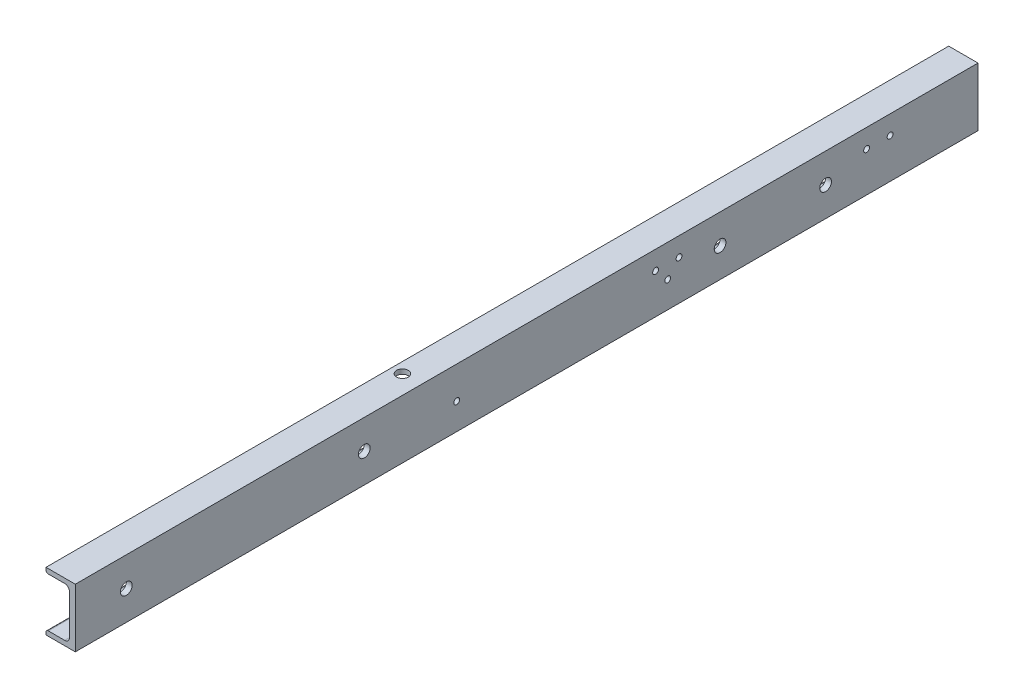
ISO-10303-21;
HEADER;
FILE_DESCRIPTION(('STEP AP214'),'2;1');
FILE_NAME('part.step','',(''),(''),'','','');
FILE_SCHEMA(('AUTOMOTIVE_DESIGN { 1 0 10303 214 1 1 1 1 }'));
ENDSEC;
DATA;
#1=APPLICATION_CONTEXT('core data for automotive mechanical design processes');
#2=APPLICATION_PROTOCOL_DEFINITION('international standard','automotive_design',2000,#1);
#3=PRODUCT_CONTEXT('',#1,'mechanical');
#4=PRODUCT('Part','Part','',(#3));
#5=PRODUCT_RELATED_PRODUCT_CATEGORY('part','',(#4));
#6=PRODUCT_DEFINITION_FORMATION('','',#4);
#7=PRODUCT_DEFINITION_CONTEXT('part definition',#1,'design');
#8=PRODUCT_DEFINITION('design','',#6,#7);
#9=PRODUCT_DEFINITION_SHAPE('','',#8);
#10=(LENGTH_UNIT() NAMED_UNIT(*) SI_UNIT(.MILLI.,.METRE.));
#11=(NAMED_UNIT(*) PLANE_ANGLE_UNIT() SI_UNIT($,.RADIAN.));
#12=(NAMED_UNIT(*) SI_UNIT($,.STERADIAN.) SOLID_ANGLE_UNIT());
#13=UNCERTAINTY_MEASURE_WITH_UNIT(LENGTH_MEASURE(1.E-05),#10,'distance_accuracy_value','');
#14=(GEOMETRIC_REPRESENTATION_CONTEXT(3) GLOBAL_UNCERTAINTY_ASSIGNED_CONTEXT((#13)) GLOBAL_UNIT_ASSIGNED_CONTEXT((#10,
#11,#12)) REPRESENTATION_CONTEXT('',''));
#15=CARTESIAN_POINT('',(0.,0.,0.));
#16=DIRECTION('',(0.,0.,1.));
#17=DIRECTION('',(1.,0.,0.));
#18=AXIS2_PLACEMENT_3D('',#15,#16,#17);
#19=CARTESIAN_POINT('',(-23.,47.9999999999999,-770.));
#20=DIRECTION('',(0.,0.,1.));
#21=DIRECTION('',(1.,0.,0.));
#22=AXIS2_PLACEMENT_3D('',#19,#20,#21);
#23=CYLINDRICAL_SURFACE('',#22,2.00000000000001);
#24=CARTESIAN_POINT('',(-23.,47.9999999999999,0.));
#25=DIRECTION('',(0.,0.,-1.));
#26=DIRECTION('',(-1.,0.,0.));
#27=AXIS2_PLACEMENT_3D('',#24,#25,#26);
#28=CIRCLE('',#27,2.00000000000001);
#29=CARTESIAN_POINT('',(-23.,45.9999999999999,0.));
#30=VERTEX_POINT('',#29);
#31=CARTESIAN_POINT('',(-25.,47.9999999999999,0.));
#32=VERTEX_POINT('',#31);
#33=EDGE_CURVE('E194',#30,#32,#28,.T.);
#34=ORIENTED_EDGE('',*,*,#33,.T.);
#35=DIRECTION('',(0.,0.,1.));
#36=VECTOR('',#35,1.);
#37=CARTESIAN_POINT('',(-25.,47.9999999999999,-770.));
#38=LINE('',#37,#36);
#39=CARTESIAN_POINT('',(-25.,47.9999999999999,-770.));
#40=VERTEX_POINT('',#39);
#41=EDGE_CURVE('E12',#40,#32,#38,.T.);
#42=ORIENTED_EDGE('',*,*,#41,.F.);
#43=CARTESIAN_POINT('',(-23.,47.9999999999999,-770.));
#44=DIRECTION('',(0.,0.,-1.));
#45=DIRECTION('',(-1.,0.,0.));
#46=AXIS2_PLACEMENT_3D('',#43,#44,#45);
#47=CIRCLE('',#46,2.00000000000001);
#48=CARTESIAN_POINT('',(-23.,45.9999999999999,-770.));
#49=VERTEX_POINT('',#48);
#50=EDGE_CURVE('E217',#49,#40,#47,.T.);
#51=ORIENTED_EDGE('',*,*,#50,.F.);
#52=DIRECTION('',(0.,0.,1.));
#53=VECTOR('',#52,1.);
#54=CARTESIAN_POINT('',(-23.,45.9999999999999,-770.));
#55=LINE('',#54,#53);
#56=EDGE_CURVE('E190',#49,#30,#55,.T.);
#57=ORIENTED_EDGE('',*,*,#56,.T.);
#58=EDGE_LOOP('',(#34,#42,#51,#57));
#59=FACE_BOUND('',#58,.T.);
#60=ADVANCED_FACE('F72',(#59),#23,.T.);
#61=CARTESIAN_POINT('',(-25.,50.,-770.));
#62=DIRECTION('',(1.,0.,0.));
#63=DIRECTION('',(0.,0.,-1.));
#64=AXIS2_PLACEMENT_3D('',#61,#62,#63);
#65=PLANE('',#64);
#66=DIRECTION('',(0.,1.,0.));
#67=VECTOR('',#66,1.);
#68=CARTESIAN_POINT('',(-25.,50.,0.));
#69=LINE('',#68,#67);
#70=CARTESIAN_POINT('',(-25.,50.,0.));
#71=VERTEX_POINT('',#70);
#72=EDGE_CURVE('E197',#32,#71,#69,.T.);
#73=ORIENTED_EDGE('',*,*,#72,.T.);
#74=DIRECTION('',(0.,0.,1.));
#75=VECTOR('',#74,1.);
#76=CARTESIAN_POINT('',(-25.,50.,-770.));
#77=LINE('',#76,#75);
#78=CARTESIAN_POINT('',(-25.,50.,-770.));
#79=VERTEX_POINT('',#78);
#80=EDGE_CURVE('E81',#79,#71,#77,.T.);
#81=ORIENTED_EDGE('',*,*,#80,.F.);
#82=DIRECTION('',(0.,1.,0.));
#83=VECTOR('',#82,1.);
#84=CARTESIAN_POINT('',(-25.,50.,-770.));
#85=LINE('',#84,#83);
#86=EDGE_CURVE('E145',#40,#79,#85,.T.);
#87=ORIENTED_EDGE('',*,*,#86,.F.);
#88=ORIENTED_EDGE('',*,*,#41,.T.);
#89=EDGE_LOOP('',(#73,#81,#87,#88));
#90=FACE_BOUND('',#89,.T.);
#91=ADVANCED_FACE('F354',(#90),#65,.F.);
#92=CARTESIAN_POINT('',(-25.,50.,-770.));
#93=DIRECTION('',(0.,-1.,0.));
#94=DIRECTION('',(1.,0.,0.));
#95=AXIS2_PLACEMENT_3D('',#92,#93,#94);
#96=PLANE('',#95);
#97=CARTESIAN_POINT('',(-16.,50.,-295.));
#98=DIRECTION('',(0.,-1.,0.));
#99=DIRECTION('',(1.,0.,0.));
#100=AXIS2_PLACEMENT_3D('',#97,#98,#99);
#101=CIRCLE('',#100,5.00000000000001);
#102=CARTESIAN_POINT('',(-11.,50.,-295.));
#103=VERTEX_POINT('',#102);
#104=EDGE_CURVE('E252',#103,#103,#101,.T.);
#105=ORIENTED_EDGE('',*,*,#104,.T.);
#106=EDGE_LOOP('',(#105));
#107=FACE_BOUND('',#106,.T.);
#108=DIRECTION('',(1.,0.,0.));
#109=VECTOR('',#108,1.);
#110=CARTESIAN_POINT('',(-25.,50.,0.));
#111=LINE('',#110,#109);
#112=CARTESIAN_POINT('',(0.,50.,0.));
#113=VERTEX_POINT('',#112);
#114=EDGE_CURVE('E200',#71,#113,#111,.T.);
#115=ORIENTED_EDGE('',*,*,#114,.T.);
#116=DIRECTION('',(0.,0.,1.));
#117=VECTOR('',#116,1.);
#118=CARTESIAN_POINT('',(0.,50.,-770.));
#119=LINE('',#118,#117);
#120=CARTESIAN_POINT('',(0.,50.,-770.));
#121=VERTEX_POINT('',#120);
#122=EDGE_CURVE('E236',#121,#113,#119,.T.);
#123=ORIENTED_EDGE('',*,*,#122,.F.);
#124=DIRECTION('',(1.,0.,0.));
#125=VECTOR('',#124,1.);
#126=CARTESIAN_POINT('',(-25.,50.,-770.));
#127=LINE('',#126,#125);
#128=EDGE_CURVE('E314',#79,#121,#127,.T.);
#129=ORIENTED_EDGE('',*,*,#128,.F.);
#130=ORIENTED_EDGE('',*,*,#80,.T.);
#131=EDGE_LOOP('',(#115,#123,#129,#130));
#132=FACE_BOUND('',#131,.T.);
#133=ADVANCED_FACE('F358',(#107,#132),#96,.F.);
#134=CARTESIAN_POINT('',(0.,50.,-770.));
#135=DIRECTION('',(-1.,0.,0.));
#136=DIRECTION('',(0.,-1.,0.));
#137=AXIS2_PLACEMENT_3D('',#134,#135,#136);
#138=PLANE('',#137);
#139=CARTESIAN_POINT('',(0.,22.4999999999925,-325.30992776085));
#140=DIRECTION('',(1.,0.,0.));
#141=DIRECTION('',(0.,1.,0.));
#142=AXIS2_PLACEMENT_3D('',#139,#140,#141);
#143=CIRCLE('',#142,2.50000000000002);
#144=CARTESIAN_POINT('',(0.,24.9999999999925,-325.30992776085));
#145=VERTEX_POINT('',#144);
#146=EDGE_CURVE('E289',#145,#145,#143,.T.);
#147=ORIENTED_EDGE('',*,*,#146,.F.);
#148=EDGE_LOOP('',(#147));
#149=FACE_BOUND('',#148,.T.);
#150=CARTESIAN_POINT('',(0.,22.4999999999926,-505.30992776085));
#151=DIRECTION('',(1.,0.,0.));
#152=DIRECTION('',(0.,1.,0.));
#153=AXIS2_PLACEMENT_3D('',#150,#151,#152);
#154=CIRCLE('',#153,2.49999999999991);
#155=CARTESIAN_POINT('',(0.,24.9999999999925,-505.30992776085));
#156=VERTEX_POINT('',#155);
#157=EDGE_CURVE('E279',#156,#156,#154,.T.);
#158=ORIENTED_EDGE('',*,*,#157,.F.);
#159=EDGE_LOOP('',(#158));
#160=FACE_BOUND('',#159,.T.);
#161=CARTESIAN_POINT('',(0.,33.95,-515.));
#162=DIRECTION('',(1.,0.,0.));
#163=DIRECTION('',(0.,0.,-1.));
#164=AXIS2_PLACEMENT_3D('',#161,#162,#163);
#165=CIRCLE('',#164,2.49999999999999);
#166=CARTESIAN_POINT('',(0.,33.95,-517.5));
#167=VERTEX_POINT('',#166);
#168=EDGE_CURVE('E276',#167,#167,#165,.T.);
#169=ORIENTED_EDGE('',*,*,#168,.F.);
#170=EDGE_LOOP('',(#169));
#171=FACE_BOUND('',#170,.T.);
#172=CARTESIAN_POINT('',(0.,33.95,-675.));
#173=DIRECTION('',(1.,0.,0.));
#174=DIRECTION('',(0.,0.,-1.));
#175=AXIS2_PLACEMENT_3D('',#172,#173,#174);
#176=CIRCLE('',#175,2.49999999999999);
#177=CARTESIAN_POINT('',(0.,33.95,-677.5));
#178=VERTEX_POINT('',#177);
#179=EDGE_CURVE('E273',#178,#178,#176,.T.);
#180=ORIENTED_EDGE('',*,*,#179,.F.);
#181=EDGE_LOOP('',(#180));
#182=FACE_BOUND('',#181,.T.);
#183=CARTESIAN_POINT('',(0.,33.95,-495.));
#184=DIRECTION('',(1.,0.,0.));
#185=DIRECTION('',(0.,0.,-1.));
#186=AXIS2_PLACEMENT_3D('',#183,#184,#185);
#187=CIRCLE('',#186,2.49999999999999);
#188=CARTESIAN_POINT('',(0.,33.95,-497.5));
#189=VERTEX_POINT('',#188);
#190=EDGE_CURVE('E269',#189,#189,#187,.T.);
#191=ORIENTED_EDGE('',*,*,#190,.F.);
#192=EDGE_LOOP('',(#191));
#193=FACE_BOUND('',#192,.T.);
#194=CARTESIAN_POINT('',(0.,33.95,-695.));
#195=DIRECTION('',(1.,0.,0.));
#196=DIRECTION('',(0.,0.,-1.));
#197=AXIS2_PLACEMENT_3D('',#194,#195,#196);
#198=CIRCLE('',#197,2.49999999999999);
#199=CARTESIAN_POINT('',(0.,33.95,-697.5));
#200=VERTEX_POINT('',#199);
#201=EDGE_CURVE('E265',#200,#200,#198,.T.);
#202=ORIENTED_EDGE('',*,*,#201,.F.);
#203=EDGE_LOOP('',(#202));
#204=FACE_BOUND('',#203,.T.);
#205=CARTESIAN_POINT('',(0.,25.,-43.5));
#206=DIRECTION('',(1.,0.,0.));
#207=DIRECTION('',(0.,0.,-1.));
#208=AXIS2_PLACEMENT_3D('',#205,#206,#207);
#209=CIRCLE('',#208,4.99999999999999);
#210=CARTESIAN_POINT('',(0.,25.,-48.4999999999999));
#211=VERTEX_POINT('',#210);
#212=EDGE_CURVE('E261',#211,#211,#209,.T.);
#213=ORIENTED_EDGE('',*,*,#212,.F.);
#214=EDGE_LOOP('',(#213));
#215=FACE_BOUND('',#214,.T.);
#216=CARTESIAN_POINT('',(0.,25.,-246.5));
#217=DIRECTION('',(1.,0.,0.));
#218=DIRECTION('',(0.,0.,-1.));
#219=AXIS2_PLACEMENT_3D('',#216,#217,#218);
#220=CIRCLE('',#219,4.99999999999999);
#221=CARTESIAN_POINT('',(0.,25.,-251.5));
#222=VERTEX_POINT('',#221);
#223=EDGE_CURVE('E257',#222,#222,#220,.T.);
#224=ORIENTED_EDGE('',*,*,#223,.F.);
#225=EDGE_LOOP('',(#224));
#226=FACE_BOUND('',#225,.T.);
#227=CARTESIAN_POINT('',(0.,25.,-550.));
#228=DIRECTION('',(1.,0.,0.));
#229=DIRECTION('',(0.,0.,-1.));
#230=AXIS2_PLACEMENT_3D('',#227,#228,#229);
#231=CIRCLE('',#230,4.99999999999999);
#232=CARTESIAN_POINT('',(0.,25.,-555.));
#233=VERTEX_POINT('',#232);
#234=EDGE_CURVE('E247',#233,#233,#231,.T.);
#235=ORIENTED_EDGE('',*,*,#234,.F.);
#236=EDGE_LOOP('',(#235));
#237=FACE_BOUND('',#236,.T.);
#238=CARTESIAN_POINT('',(0.,25.,-640.));
#239=DIRECTION('',(1.,0.,0.));
#240=DIRECTION('',(0.,0.,-1.));
#241=AXIS2_PLACEMENT_3D('',#238,#239,#240);
#242=CIRCLE('',#241,4.99999999999999);
#243=CARTESIAN_POINT('',(0.,25.,-645.));
#244=VERTEX_POINT('',#243);
#245=EDGE_CURVE('E243',#244,#244,#242,.T.);
#246=ORIENTED_EDGE('',*,*,#245,.F.);
#247=EDGE_LOOP('',(#246));
#248=FACE_BOUND('',#247,.T.);
#249=DIRECTION('',(0.,-1.,0.));
#250=VECTOR('',#249,1.);
#251=CARTESIAN_POINT('',(0.,50.,0.));
#252=LINE('',#251,#250);
#253=CARTESIAN_POINT('',(0.,0.,0.));
#254=VERTEX_POINT('',#253);
#255=EDGE_CURVE('E202',#113,#254,#252,.T.);
#256=ORIENTED_EDGE('',*,*,#255,.T.);
#257=DIRECTION('',(0.,0.,1.));
#258=VECTOR('',#257,1.);
#259=CARTESIAN_POINT('',(0.,0.,-770.));
#260=LINE('',#259,#258);
#261=CARTESIAN_POINT('',(0.,0.,-770.));
#262=VERTEX_POINT('',#261);
#263=EDGE_CURVE('E233',#262,#254,#260,.T.);
#264=ORIENTED_EDGE('',*,*,#263,.F.);
#265=DIRECTION('',(0.,-1.,0.));
#266=VECTOR('',#265,1.);
#267=CARTESIAN_POINT('',(0.,50.,-770.));
#268=LINE('',#267,#266);
#269=EDGE_CURVE('E316',#121,#262,#268,.T.);
#270=ORIENTED_EDGE('',*,*,#269,.F.);
#271=ORIENTED_EDGE('',*,*,#122,.T.);
#272=EDGE_LOOP('',(#256,#264,#270,#271));
#273=FACE_BOUND('',#272,.T.);
#274=ADVANCED_FACE('F362',(#149,#160,#171,#182,#193,#204,#215,#226,#237,#248,#273),#138,.F.);
#275=CARTESIAN_POINT('',(-25.,0.,-770.));
#276=DIRECTION('',(0.,1.,0.));
#277=DIRECTION('',(-1.,0.,0.));
#278=AXIS2_PLACEMENT_3D('',#275,#276,#277);
#279=PLANE('',#278);
#280=CARTESIAN_POINT('',(-16.,0.,-295.));
#281=DIRECTION('',(0.,-1.,0.));
#282=DIRECTION('',(1.,0.,0.));
#283=AXIS2_PLACEMENT_3D('',#280,#281,#282);
#284=CIRCLE('',#283,5.00000000000001);
#285=CARTESIAN_POINT('',(-11.,0.,-295.));
#286=VERTEX_POINT('',#285);
#287=EDGE_CURVE('E256',#286,#286,#284,.T.);
#288=ORIENTED_EDGE('',*,*,#287,.F.);
#289=EDGE_LOOP('',(#288));
#290=FACE_BOUND('',#289,.T.);
#291=DIRECTION('',(-1.,0.,0.));
#292=VECTOR('',#291,1.);
#293=CARTESIAN_POINT('',(-25.,0.,0.));
#294=LINE('',#293,#292);
#295=CARTESIAN_POINT('',(-25.,0.,0.));
#296=VERTEX_POINT('',#295);
#297=EDGE_CURVE('E204',#254,#296,#294,.T.);
#298=ORIENTED_EDGE('',*,*,#297,.T.);
#299=DIRECTION('',(0.,0.,1.));
#300=VECTOR('',#299,1.);
#301=CARTESIAN_POINT('',(-25.,0.,-770.));
#302=LINE('',#301,#300);
#303=CARTESIAN_POINT('',(-25.,0.,-770.));
#304=VERTEX_POINT('',#303);
#305=EDGE_CURVE('E230',#304,#296,#302,.T.);
#306=ORIENTED_EDGE('',*,*,#305,.F.);
#307=DIRECTION('',(-1.,0.,0.));
#308=VECTOR('',#307,1.);
#309=CARTESIAN_POINT('',(-25.,0.,-770.));
#310=LINE('',#309,#308);
#311=EDGE_CURVE('E318',#262,#304,#310,.T.);
#312=ORIENTED_EDGE('',*,*,#311,.F.);
#313=ORIENTED_EDGE('',*,*,#263,.T.);
#314=EDGE_LOOP('',(#298,#306,#312,#313));
#315=FACE_BOUND('',#314,.T.);
#316=ADVANCED_FACE('F368',(#290,#315),#279,.F.);
#317=CARTESIAN_POINT('',(-25.,0.,-770.));
#318=DIRECTION('',(1.,0.,0.));
#319=DIRECTION('',(0.,0.,-1.));
#320=AXIS2_PLACEMENT_3D('',#317,#318,#319);
#321=PLANE('',#320);
#322=DIRECTION('',(0.,1.,0.));
#323=VECTOR('',#322,1.);
#324=CARTESIAN_POINT('',(-25.,0.,0.));
#325=LINE('',#324,#323);
#326=CARTESIAN_POINT('',(-25.,2.00000000000009,0.));
#327=VERTEX_POINT('',#326);
#328=EDGE_CURVE('E206',#296,#327,#325,.T.);
#329=ORIENTED_EDGE('',*,*,#328,.T.);
#330=DIRECTION('',(0.,0.,1.));
#331=VECTOR('',#330,1.);
#332=CARTESIAN_POINT('',(-25.,2.00000000000009,-770.));
#333=LINE('',#332,#331);
#334=CARTESIAN_POINT('',(-25.,2.00000000000009,-770.));
#335=VERTEX_POINT('',#334);
#336=EDGE_CURVE('E227',#335,#327,#333,.T.);
#337=ORIENTED_EDGE('',*,*,#336,.F.);
#338=DIRECTION('',(0.,1.,0.));
#339=VECTOR('',#338,1.);
#340=CARTESIAN_POINT('',(-25.,0.,-770.));
#341=LINE('',#340,#339);
#342=EDGE_CURVE('E320',#304,#335,#341,.T.);
#343=ORIENTED_EDGE('',*,*,#342,.F.);
#344=ORIENTED_EDGE('',*,*,#305,.T.);
#345=EDGE_LOOP('',(#329,#337,#343,#344));
#346=FACE_BOUND('',#345,.T.);
#347=ADVANCED_FACE('F372',(#346),#321,.F.);
#348=CARTESIAN_POINT('',(-23.,2.00000000000009,-770.));
#349=DIRECTION('',(0.,0.,1.));
#350=DIRECTION('',(1.,0.,0.));
#351=AXIS2_PLACEMENT_3D('',#348,#349,#350);
#352=CYLINDRICAL_SURFACE('',#351,2.);
#353=CARTESIAN_POINT('',(-23.,2.00000000000009,0.));
#354=DIRECTION('',(0.,0.,-1.));
#355=DIRECTION('',(1.,0.,0.));
#356=AXIS2_PLACEMENT_3D('',#353,#354,#355);
#357=CIRCLE('',#356,2.);
#358=CARTESIAN_POINT('',(-23.,4.00000000000009,0.));
#359=VERTEX_POINT('',#358);
#360=EDGE_CURVE('E208',#327,#359,#357,.T.);
#361=ORIENTED_EDGE('',*,*,#360,.T.);
#362=DIRECTION('',(0.,0.,1.));
#363=VECTOR('',#362,1.);
#364=CARTESIAN_POINT('',(-23.,4.00000000000009,-770.));
#365=LINE('',#364,#363);
#366=CARTESIAN_POINT('',(-23.,4.00000000000009,-770.));
#367=VERTEX_POINT('',#366);
#368=EDGE_CURVE('E224',#367,#359,#365,.T.);
#369=ORIENTED_EDGE('',*,*,#368,.F.);
#370=CARTESIAN_POINT('',(-23.,2.00000000000009,-770.));
#371=DIRECTION('',(0.,0.,-1.));
#372=DIRECTION('',(1.,0.,0.));
#373=AXIS2_PLACEMENT_3D('',#370,#371,#372);
#374=CIRCLE('',#373,2.);
#375=EDGE_CURVE('E322',#335,#367,#374,.T.);
#376=ORIENTED_EDGE('',*,*,#375,.F.);
#377=ORIENTED_EDGE('',*,*,#336,.T.);
#378=EDGE_LOOP('',(#361,#369,#376,#377));
#379=FACE_BOUND('',#378,.T.);
#380=ADVANCED_FACE('F376',(#379),#352,.T.);
#381=CARTESIAN_POINT('',(-9.00000000000003,4.00000000000001,-770.));
#382=DIRECTION('',(0.,-1.,0.));
#383=DIRECTION('',(1.,0.,0.));
#384=AXIS2_PLACEMENT_3D('',#381,#382,#383);
#385=PLANE('',#384);
#386=CARTESIAN_POINT('',(-16.,4.00000000000005,-295.));
#387=DIRECTION('',(0.,-1.,0.));
#388=DIRECTION('',(1.,0.,0.));
#389=AXIS2_PLACEMENT_3D('',#386,#387,#388);
#390=CIRCLE('',#389,5.00000000000001);
#391=CARTESIAN_POINT('',(-11.,4.00000000000001,-295.));
#392=VERTEX_POINT('',#391);
#393=EDGE_CURVE('E251',#392,#392,#390,.T.);
#394=ORIENTED_EDGE('',*,*,#393,.T.);
#395=EDGE_LOOP('',(#394));
#396=FACE_BOUND('',#395,.T.);
#397=DIRECTION('',(1.,0.,0.));
#398=VECTOR('',#397,1.);
#399=CARTESIAN_POINT('',(-9.00000000000003,4.00000000000001,0.));
#400=LINE('',#399,#398);
#401=CARTESIAN_POINT('',(-9.00000000000003,4.00000000000001,0.));
#402=VERTEX_POINT('',#401);
#403=EDGE_CURVE('E210',#359,#402,#400,.T.);
#404=ORIENTED_EDGE('',*,*,#403,.T.);
#405=DIRECTION('',(0.,0.,1.));
#406=VECTOR('',#405,1.);
#407=CARTESIAN_POINT('',(-9.00000000000003,4.00000000000001,-770.));
#408=LINE('',#407,#406);
#409=CARTESIAN_POINT('',(-9.00000000000003,4.00000000000001,-770.));
#410=VERTEX_POINT('',#409);
#411=EDGE_CURVE('E221',#410,#402,#408,.T.);
#412=ORIENTED_EDGE('',*,*,#411,.F.);
#413=DIRECTION('',(1.,0.,0.));
#414=VECTOR('',#413,1.);
#415=CARTESIAN_POINT('',(-9.00000000000003,4.00000000000001,-770.));
#416=LINE('',#415,#414);
#417=EDGE_CURVE('E324',#367,#410,#416,.T.);
#418=ORIENTED_EDGE('',*,*,#417,.F.);
#419=ORIENTED_EDGE('',*,*,#368,.T.);
#420=EDGE_LOOP('',(#404,#412,#418,#419));
#421=FACE_BOUND('',#420,.T.);
#422=ADVANCED_FACE('F330',(#396,#421),#385,.F.);
#423=CARTESIAN_POINT('',(-9.00000000000001,8.00000000000001,-770.));
#424=DIRECTION('',(0.,0.,1.));
#425=DIRECTION('',(1.,0.,0.));
#426=AXIS2_PLACEMENT_3D('',#423,#424,#425);
#427=CYLINDRICAL_SURFACE('',#426,4.);
#428=CARTESIAN_POINT('',(-9.00000000000001,8.00000000000001,0.));
#429=DIRECTION('',(0.,0.,1.));
#430=DIRECTION('',(-1.,0.,0.));
#431=AXIS2_PLACEMENT_3D('',#428,#429,#430);
#432=CIRCLE('',#431,4.);
#433=CARTESIAN_POINT('',(-5.,8.00000000000001,0.));
#434=VERTEX_POINT('',#433);
#435=EDGE_CURVE('E212',#402,#434,#432,.T.);
#436=ORIENTED_EDGE('',*,*,#435,.T.);
#437=DIRECTION('',(0.,0.,1.));
#438=VECTOR('',#437,1.);
#439=CARTESIAN_POINT('',(-5.,8.00000000000001,-770.));
#440=LINE('',#439,#438);
#441=CARTESIAN_POINT('',(-5.,8.00000000000001,-770.));
#442=VERTEX_POINT('',#441);
#443=EDGE_CURVE('E185',#442,#434,#440,.T.);
#444=ORIENTED_EDGE('',*,*,#443,.F.);
#445=CARTESIAN_POINT('',(-9.00000000000001,8.00000000000001,-770.));
#446=DIRECTION('',(0.,0.,1.));
#447=DIRECTION('',(-1.,0.,0.));
#448=AXIS2_PLACEMENT_3D('',#445,#446,#447);
#449=CIRCLE('',#448,4.);
#450=EDGE_CURVE('E176',#410,#442,#449,.T.);
#451=ORIENTED_EDGE('',*,*,#450,.F.);
#452=ORIENTED_EDGE('',*,*,#411,.T.);
#453=EDGE_LOOP('',(#436,#444,#451,#452));
#454=FACE_BOUND('',#453,.T.);
#455=ADVANCED_FACE('F334',(#454),#427,.F.);
#456=CARTESIAN_POINT('',(-5.,42.,-770.));
#457=DIRECTION('',(1.,0.,0.));
#458=DIRECTION('',(0.,1.,0.));
#459=AXIS2_PLACEMENT_3D('',#456,#457,#458);
#460=PLANE('',#459);
#461=CARTESIAN_POINT('',(-5.,22.4999999999925,-325.30992776085));
#462=DIRECTION('',(1.,0.,0.));
#463=DIRECTION('',(0.,1.,0.));
#464=AXIS2_PLACEMENT_3D('',#461,#462,#463);
#465=CIRCLE('',#464,2.50000000000002);
#466=CARTESIAN_POINT('',(-5.,24.9999999999925,-325.30992776085));
#467=VERTEX_POINT('',#466);
#468=EDGE_CURVE('E75',#467,#467,#465,.T.);
#469=ORIENTED_EDGE('',*,*,#468,.T.);
#470=EDGE_LOOP('',(#469));
#471=FACE_BOUND('',#470,.T.);
#472=CARTESIAN_POINT('',(-5.,22.4999999999926,-505.30992776085));
#473=DIRECTION('',(1.,0.,0.));
#474=DIRECTION('',(0.,1.,0.));
#475=AXIS2_PLACEMENT_3D('',#472,#473,#474);
#476=CIRCLE('',#475,2.49999999999991);
#477=CARTESIAN_POINT('',(-5.,24.9999999999925,-505.30992776085));
#478=VERTEX_POINT('',#477);
#479=EDGE_CURVE('E277',#478,#478,#476,.T.);
#480=ORIENTED_EDGE('',*,*,#479,.T.);
#481=EDGE_LOOP('',(#480));
#482=FACE_BOUND('',#481,.T.);
#483=CARTESIAN_POINT('',(-5.,33.95,-515.));
#484=DIRECTION('',(1.,0.,0.));
#485=DIRECTION('',(0.,1.,0.));
#486=AXIS2_PLACEMENT_3D('',#483,#484,#485);
#487=CIRCLE('',#486,2.49999999999999);
#488=CARTESIAN_POINT('',(-5.,36.45,-515.));
#489=VERTEX_POINT('',#488);
#490=EDGE_CURVE('E274',#489,#489,#487,.T.);
#491=ORIENTED_EDGE('',*,*,#490,.T.);
#492=EDGE_LOOP('',(#491));
#493=FACE_BOUND('',#492,.T.);
#494=CARTESIAN_POINT('',(-5.,33.95,-675.));
#495=DIRECTION('',(1.,0.,0.));
#496=DIRECTION('',(0.,1.,0.));
#497=AXIS2_PLACEMENT_3D('',#494,#495,#496);
#498=CIRCLE('',#497,2.49999999999999);
#499=CARTESIAN_POINT('',(-5.,36.45,-675.));
#500=VERTEX_POINT('',#499);
#501=EDGE_CURVE('E270',#500,#500,#498,.T.);
#502=ORIENTED_EDGE('',*,*,#501,.T.);
#503=EDGE_LOOP('',(#502));
#504=FACE_BOUND('',#503,.T.);
#505=CARTESIAN_POINT('',(-5.,33.95,-495.));
#506=DIRECTION('',(1.,0.,0.));
#507=DIRECTION('',(0.,1.,0.));
#508=AXIS2_PLACEMENT_3D('',#505,#506,#507);
#509=CIRCLE('',#508,2.49999999999999);
#510=CARTESIAN_POINT('',(-5.,36.45,-495.));
#511=VERTEX_POINT('',#510);
#512=EDGE_CURVE('E266',#511,#511,#509,.T.);
#513=ORIENTED_EDGE('',*,*,#512,.T.);
#514=EDGE_LOOP('',(#513));
#515=FACE_BOUND('',#514,.T.);
#516=CARTESIAN_POINT('',(-5.,33.95,-695.));
#517=DIRECTION('',(1.,0.,0.));
#518=DIRECTION('',(0.,1.,0.));
#519=AXIS2_PLACEMENT_3D('',#516,#517,#518);
#520=CIRCLE('',#519,2.49999999999999);
#521=CARTESIAN_POINT('',(-5.,36.45,-695.));
#522=VERTEX_POINT('',#521);
#523=EDGE_CURVE('E262',#522,#522,#520,.T.);
#524=ORIENTED_EDGE('',*,*,#523,.T.);
#525=EDGE_LOOP('',(#524));
#526=FACE_BOUND('',#525,.T.);
#527=CARTESIAN_POINT('',(-5.,25.,-43.5));
#528=DIRECTION('',(1.,0.,0.));
#529=DIRECTION('',(0.,1.,0.));
#530=AXIS2_PLACEMENT_3D('',#527,#528,#529);
#531=CIRCLE('',#530,4.99999999999999);
#532=CARTESIAN_POINT('',(-5.,30.,-43.5));
#533=VERTEX_POINT('',#532);
#534=EDGE_CURVE('E258',#533,#533,#531,.T.);
#535=ORIENTED_EDGE('',*,*,#534,.T.);
#536=EDGE_LOOP('',(#535));
#537=FACE_BOUND('',#536,.T.);
#538=CARTESIAN_POINT('',(-5.,25.,-246.5));
#539=DIRECTION('',(1.,0.,0.));
#540=DIRECTION('',(0.,1.,0.));
#541=AXIS2_PLACEMENT_3D('',#538,#539,#540);
#542=CIRCLE('',#541,4.99999999999999);
#543=CARTESIAN_POINT('',(-5.,30.,-246.5));
#544=VERTEX_POINT('',#543);
#545=EDGE_CURVE('E253',#544,#544,#542,.T.);
#546=ORIENTED_EDGE('',*,*,#545,.T.);
#547=EDGE_LOOP('',(#546));
#548=FACE_BOUND('',#547,.T.);
#549=CARTESIAN_POINT('',(-5.,25.,-550.));
#550=DIRECTION('',(1.,0.,0.));
#551=DIRECTION('',(0.,1.,0.));
#552=AXIS2_PLACEMENT_3D('',#549,#550,#551);
#553=CIRCLE('',#552,4.99999999999999);
#554=CARTESIAN_POINT('',(-5.,30.,-550.));
#555=VERTEX_POINT('',#554);
#556=EDGE_CURVE('E244',#555,#555,#553,.T.);
#557=ORIENTED_EDGE('',*,*,#556,.T.);
#558=EDGE_LOOP('',(#557));
#559=FACE_BOUND('',#558,.T.);
#560=CARTESIAN_POINT('',(-5.,25.,-640.));
#561=DIRECTION('',(1.,0.,0.));
#562=DIRECTION('',(0.,1.,0.));
#563=AXIS2_PLACEMENT_3D('',#560,#561,#562);
#564=CIRCLE('',#563,4.99999999999999);
#565=CARTESIAN_POINT('',(-5.,30.,-640.));
#566=VERTEX_POINT('',#565);
#567=EDGE_CURVE('E198',#566,#566,#564,.T.);
#568=ORIENTED_EDGE('',*,*,#567,.T.);
#569=EDGE_LOOP('',(#568));
#570=FACE_BOUND('',#569,.T.);
#571=DIRECTION('',(0.,1.,0.));
#572=VECTOR('',#571,1.);
#573=CARTESIAN_POINT('',(-5.,42.,0.));
#574=LINE('',#573,#572);
#575=CARTESIAN_POINT('',(-5.,42.,0.));
#576=VERTEX_POINT('',#575);
#577=EDGE_CURVE('E184',#434,#576,#574,.T.);
#578=ORIENTED_EDGE('',*,*,#577,.T.);
#579=DIRECTION('',(0.,0.,1.));
#580=VECTOR('',#579,1.);
#581=CARTESIAN_POINT('',(-5.,42.,-770.));
#582=LINE('',#581,#580);
#583=CARTESIAN_POINT('',(-5.,42.,-770.));
#584=VERTEX_POINT('',#583);
#585=EDGE_CURVE('E181',#584,#576,#582,.T.);
#586=ORIENTED_EDGE('',*,*,#585,.F.);
#587=DIRECTION('',(0.,1.,0.));
#588=VECTOR('',#587,1.);
#589=CARTESIAN_POINT('',(-5.,42.,-770.));
#590=LINE('',#589,#588);
#591=EDGE_CURVE('E170',#442,#584,#590,.T.);
#592=ORIENTED_EDGE('',*,*,#591,.F.);
#593=ORIENTED_EDGE('',*,*,#443,.T.);
#594=EDGE_LOOP('',(#578,#586,#592,#593));
#595=FACE_BOUND('',#594,.T.);
#596=ADVANCED_FACE('F182',(#471,#482,#493,#504,#515,#526,#537,#548,#559,#570,#595),#460,.F.);
#597=CARTESIAN_POINT('',(-9.,42.,-770.));
#598=DIRECTION('',(0.,0.,1.));
#599=DIRECTION('',(1.,0.,0.));
#600=AXIS2_PLACEMENT_3D('',#597,#598,#599);
#601=CYLINDRICAL_SURFACE('',#600,4.);
#602=CARTESIAN_POINT('',(-9.,42.,0.));
#603=DIRECTION('',(0.,0.,1.));
#604=DIRECTION('',(1.,0.,0.));
#605=AXIS2_PLACEMENT_3D('',#602,#603,#604);
#606=CIRCLE('',#605,4.);
#607=CARTESIAN_POINT('',(-9.00000000000003,46.,0.));
#608=VERTEX_POINT('',#607);
#609=EDGE_CURVE('E131',#576,#608,#606,.T.);
#610=ORIENTED_EDGE('',*,*,#609,.T.);
#611=DIRECTION('',(0.,0.,1.));
#612=VECTOR('',#611,1.);
#613=CARTESIAN_POINT('',(-9.00000000000003,46.,-770.));
#614=LINE('',#613,#612);
#615=CARTESIAN_POINT('',(-9.00000000000003,46.,-770.));
#616=VERTEX_POINT('',#615);
#617=EDGE_CURVE('E186',#616,#608,#614,.T.);
#618=ORIENTED_EDGE('',*,*,#617,.F.);
#619=CARTESIAN_POINT('',(-9.,42.,-770.));
#620=DIRECTION('',(0.,0.,1.));
#621=DIRECTION('',(1.,0.,0.));
#622=AXIS2_PLACEMENT_3D('',#619,#620,#621);
#623=CIRCLE('',#622,4.);
#624=EDGE_CURVE('E174',#584,#616,#623,.T.);
#625=ORIENTED_EDGE('',*,*,#624,.F.);
#626=ORIENTED_EDGE('',*,*,#585,.T.);
#627=EDGE_LOOP('',(#610,#618,#625,#626));
#628=FACE_BOUND('',#627,.T.);
#629=ADVANCED_FACE('F188',(#628),#601,.F.);
#630=CARTESIAN_POINT('',(-9.00000000000003,46.,-770.));
#631=DIRECTION('',(0.,1.,0.));
#632=DIRECTION('',(-1.,0.,0.));
#633=AXIS2_PLACEMENT_3D('',#630,#631,#632);
#634=PLANE('',#633);
#635=CARTESIAN_POINT('',(-16.,46.,-295.));
#636=DIRECTION('',(0.,1.,0.));
#637=DIRECTION('',(-1.,0.,0.));
#638=AXIS2_PLACEMENT_3D('',#635,#636,#637);
#639=CIRCLE('',#638,5.00000000000001);
#640=CARTESIAN_POINT('',(-21.,45.9999999999999,-295.));
#641=VERTEX_POINT('',#640);
#642=EDGE_CURVE('E248',#641,#641,#639,.T.);
#643=ORIENTED_EDGE('',*,*,#642,.T.);
#644=EDGE_LOOP('',(#643));
#645=FACE_BOUND('',#644,.T.);
#646=DIRECTION('',(-1.,0.,0.));
#647=VECTOR('',#646,1.);
#648=CARTESIAN_POINT('',(-9.00000000000003,46.,0.));
#649=LINE('',#648,#647);
#650=EDGE_CURVE('E137',#608,#30,#649,.T.);
#651=ORIENTED_EDGE('',*,*,#650,.T.);
#652=ORIENTED_EDGE('',*,*,#56,.F.);
#653=DIRECTION('',(-1.,0.,0.));
#654=VECTOR('',#653,1.);
#655=CARTESIAN_POINT('',(-9.00000000000003,46.,-770.));
#656=LINE('',#655,#654);
#657=EDGE_CURVE('E90',#616,#49,#656,.T.);
#658=ORIENTED_EDGE('',*,*,#657,.F.);
#659=ORIENTED_EDGE('',*,*,#617,.T.);
#660=EDGE_LOOP('',(#651,#652,#658,#659));
#661=FACE_BOUND('',#660,.T.);
#662=ADVANCED_FACE('F342',(#645,#661),#634,.F.);
#663=CARTESIAN_POINT('',(-23.,47.9999999999999,-770.));
#664=DIRECTION('',(0.,0.,-1.));
#665=DIRECTION('',(-1.,0.,0.));
#666=AXIS2_PLACEMENT_3D('',#663,#664,#665);
#667=PLANE('',#666);
#668=ORIENTED_EDGE('',*,*,#50,.T.);
#669=ORIENTED_EDGE('',*,*,#86,.T.);
#670=ORIENTED_EDGE('',*,*,#128,.T.);
#671=ORIENTED_EDGE('',*,*,#269,.T.);
#672=ORIENTED_EDGE('',*,*,#311,.T.);
#673=ORIENTED_EDGE('',*,*,#342,.T.);
#674=ORIENTED_EDGE('',*,*,#375,.T.);
#675=ORIENTED_EDGE('',*,*,#417,.T.);
#676=ORIENTED_EDGE('',*,*,#450,.T.);
#677=ORIENTED_EDGE('',*,*,#591,.T.);
#678=ORIENTED_EDGE('',*,*,#624,.T.);
#679=ORIENTED_EDGE('',*,*,#657,.T.);
#680=EDGE_LOOP('',(#668,#669,#670,#671,#672,#673,#674,#675,#676,#677,#678,#679));
#681=FACE_BOUND('',#680,.T.);
#682=ADVANCED_FACE('F172',(#681),#667,.T.);
#683=CARTESIAN_POINT('',(-23.,47.9999999999999,0.));
#684=DIRECTION('',(0.,0.,-1.));
#685=DIRECTION('',(-1.,0.,0.));
#686=AXIS2_PLACEMENT_3D('',#683,#684,#685);
#687=PLANE('',#686);
#688=ORIENTED_EDGE('',*,*,#33,.F.);
#689=ORIENTED_EDGE('',*,*,#650,.F.);
#690=ORIENTED_EDGE('',*,*,#609,.F.);
#691=ORIENTED_EDGE('',*,*,#577,.F.);
#692=ORIENTED_EDGE('',*,*,#435,.F.);
#693=ORIENTED_EDGE('',*,*,#403,.F.);
#694=ORIENTED_EDGE('',*,*,#360,.F.);
#695=ORIENTED_EDGE('',*,*,#328,.F.);
#696=ORIENTED_EDGE('',*,*,#297,.F.);
#697=ORIENTED_EDGE('',*,*,#255,.F.);
#698=ORIENTED_EDGE('',*,*,#114,.F.);
#699=ORIENTED_EDGE('',*,*,#72,.F.);
#700=EDGE_LOOP('',(#688,#689,#690,#691,#692,#693,#694,#695,#696,#697,#698,#699));
#701=FACE_BOUND('',#700,.T.);
#702=ADVANCED_FACE('F337',(#701),#687,.F.);
#703=CARTESIAN_POINT('',(0.,25.,-640.));
#704=DIRECTION('',(1.,0.,0.));
#705=DIRECTION('',(0.,0.,-1.));
#706=AXIS2_PLACEMENT_3D('',#703,#704,#705);
#707=CYLINDRICAL_SURFACE('',#706,4.99999999999999);
#708=ORIENTED_EDGE('',*,*,#245,.T.);
#709=EDGE_LOOP('',(#708));
#710=FACE_BOUND('',#709,.T.);
#711=ORIENTED_EDGE('',*,*,#567,.F.);
#712=EDGE_LOOP('',(#711));
#713=FACE_BOUND('',#712,.T.);
#714=ADVANCED_FACE('F408',(#710,#713),#707,.F.);
#715=CARTESIAN_POINT('',(0.,25.,-550.));
#716=DIRECTION('',(1.,0.,0.));
#717=DIRECTION('',(0.,0.,-1.));
#718=AXIS2_PLACEMENT_3D('',#715,#716,#717);
#719=CYLINDRICAL_SURFACE('',#718,4.99999999999999);
#720=ORIENTED_EDGE('',*,*,#234,.T.);
#721=EDGE_LOOP('',(#720));
#722=FACE_BOUND('',#721,.T.);
#723=ORIENTED_EDGE('',*,*,#556,.F.);
#724=EDGE_LOOP('',(#723));
#725=FACE_BOUND('',#724,.T.);
#726=ADVANCED_FACE('F410',(#722,#725),#719,.F.);
#727=CARTESIAN_POINT('',(-16.,50.,-295.));
#728=DIRECTION('',(0.,-1.,0.));
#729=DIRECTION('',(1.,0.,0.));
#730=AXIS2_PLACEMENT_3D('',#727,#728,#729);
#731=CYLINDRICAL_SURFACE('',#730,5.00000000000001);
#732=ORIENTED_EDGE('',*,*,#104,.F.);
#733=EDGE_LOOP('',(#732));
#734=FACE_BOUND('',#733,.T.);
#735=ORIENTED_EDGE('',*,*,#642,.F.);
#736=EDGE_LOOP('',(#735));
#737=FACE_BOUND('',#736,.T.);
#738=ADVANCED_FACE('F417',(#734,#737),#731,.F.);
#739=ORIENTED_EDGE('',*,*,#287,.T.);
#740=EDGE_LOOP('',(#739));
#741=FACE_BOUND('',#740,.T.);
#742=ORIENTED_EDGE('',*,*,#393,.F.);
#743=EDGE_LOOP('',(#742));
#744=FACE_BOUND('',#743,.T.);
#745=ADVANCED_FACE('F421',(#741,#744),#731,.F.);
#746=CARTESIAN_POINT('',(0.,25.,-246.5));
#747=DIRECTION('',(1.,0.,0.));
#748=DIRECTION('',(0.,0.,-1.));
#749=AXIS2_PLACEMENT_3D('',#746,#747,#748);
#750=CYLINDRICAL_SURFACE('',#749,4.99999999999999);
#751=ORIENTED_EDGE('',*,*,#223,.T.);
#752=EDGE_LOOP('',(#751));
#753=FACE_BOUND('',#752,.T.);
#754=ORIENTED_EDGE('',*,*,#545,.F.);
#755=EDGE_LOOP('',(#754));
#756=FACE_BOUND('',#755,.T.);
#757=ADVANCED_FACE('F424',(#753,#756),#750,.F.);
#758=CARTESIAN_POINT('',(0.,25.,-43.5));
#759=DIRECTION('',(1.,0.,0.));
#760=DIRECTION('',(0.,0.,-1.));
#761=AXIS2_PLACEMENT_3D('',#758,#759,#760);
#762=CYLINDRICAL_SURFACE('',#761,4.99999999999999);
#763=ORIENTED_EDGE('',*,*,#212,.T.);
#764=EDGE_LOOP('',(#763));
#765=FACE_BOUND('',#764,.T.);
#766=ORIENTED_EDGE('',*,*,#534,.F.);
#767=EDGE_LOOP('',(#766));
#768=FACE_BOUND('',#767,.T.);
#769=ADVANCED_FACE('F428',(#765,#768),#762,.F.);
#770=CARTESIAN_POINT('',(0.,33.95,-695.));
#771=DIRECTION('',(1.,0.,0.));
#772=DIRECTION('',(0.,0.,-1.));
#773=AXIS2_PLACEMENT_3D('',#770,#771,#772);
#774=CYLINDRICAL_SURFACE('',#773,2.49999999999999);
#775=ORIENTED_EDGE('',*,*,#201,.T.);
#776=EDGE_LOOP('',(#775));
#777=FACE_BOUND('',#776,.T.);
#778=ORIENTED_EDGE('',*,*,#523,.F.);
#779=EDGE_LOOP('',(#778));
#780=FACE_BOUND('',#779,.T.);
#781=ADVANCED_FACE('F432',(#777,#780),#774,.F.);
#782=CARTESIAN_POINT('',(0.,33.95,-495.));
#783=DIRECTION('',(1.,0.,0.));
#784=DIRECTION('',(0.,0.,-1.));
#785=AXIS2_PLACEMENT_3D('',#782,#783,#784);
#786=CYLINDRICAL_SURFACE('',#785,2.49999999999999);
#787=ORIENTED_EDGE('',*,*,#190,.T.);
#788=EDGE_LOOP('',(#787));
#789=FACE_BOUND('',#788,.T.);
#790=ORIENTED_EDGE('',*,*,#512,.F.);
#791=EDGE_LOOP('',(#790));
#792=FACE_BOUND('',#791,.T.);
#793=ADVANCED_FACE('F436',(#789,#792),#786,.F.);
#794=CARTESIAN_POINT('',(0.,33.95,-675.));
#795=DIRECTION('',(1.,0.,0.));
#796=DIRECTION('',(0.,0.,-1.));
#797=AXIS2_PLACEMENT_3D('',#794,#795,#796);
#798=CYLINDRICAL_SURFACE('',#797,2.49999999999999);
#799=ORIENTED_EDGE('',*,*,#179,.T.);
#800=EDGE_LOOP('',(#799));
#801=FACE_BOUND('',#800,.T.);
#802=ORIENTED_EDGE('',*,*,#501,.F.);
#803=EDGE_LOOP('',(#802));
#804=FACE_BOUND('',#803,.T.);
#805=ADVANCED_FACE('F440',(#801,#804),#798,.F.);
#806=CARTESIAN_POINT('',(0.,33.95,-515.));
#807=DIRECTION('',(1.,0.,0.));
#808=DIRECTION('',(0.,0.,-1.));
#809=AXIS2_PLACEMENT_3D('',#806,#807,#808);
#810=CYLINDRICAL_SURFACE('',#809,2.49999999999999);
#811=ORIENTED_EDGE('',*,*,#168,.T.);
#812=EDGE_LOOP('',(#811));
#813=FACE_BOUND('',#812,.T.);
#814=ORIENTED_EDGE('',*,*,#490,.F.);
#815=EDGE_LOOP('',(#814));
#816=FACE_BOUND('',#815,.T.);
#817=ADVANCED_FACE('F444',(#813,#816),#810,.F.);
#818=CARTESIAN_POINT('',(-10.,22.4999999999926,-505.30992776085));
#819=DIRECTION('',(1.,0.,0.));
#820=DIRECTION('',(0.,1.,0.));
#821=AXIS2_PLACEMENT_3D('',#818,#819,#820);
#822=CYLINDRICAL_SURFACE('',#821,2.49999999999991);
#823=ORIENTED_EDGE('',*,*,#157,.T.);
#824=EDGE_LOOP('',(#823));
#825=FACE_BOUND('',#824,.T.);
#826=ORIENTED_EDGE('',*,*,#479,.F.);
#827=EDGE_LOOP('',(#826));
#828=FACE_BOUND('',#827,.T.);
#829=ADVANCED_FACE('F448',(#825,#828),#822,.F.);
#830=CARTESIAN_POINT('',(-10.,22.4999999999925,-325.30992776085));
#831=DIRECTION('',(1.,0.,0.));
#832=DIRECTION('',(0.,1.,0.));
#833=AXIS2_PLACEMENT_3D('',#830,#831,#832);
#834=CYLINDRICAL_SURFACE('',#833,2.50000000000002);
#835=ORIENTED_EDGE('',*,*,#146,.T.);
#836=EDGE_LOOP('',(#835));
#837=FACE_BOUND('',#836,.T.);
#838=ORIENTED_EDGE('',*,*,#468,.F.);
#839=EDGE_LOOP('',(#838));
#840=FACE_BOUND('',#839,.T.);
#841=ADVANCED_FACE('F452',(#837,#840),#834,.F.);
#842=CLOSED_SHELL('',(#60,#91,#133,#274,#316,#347,#380,#422,#455,#596,#629,#662,#682,#702,#714,
#726,#738,#745,#757,#769,#781,#793,#805,#817,#829,#841));
#843=MANIFOLD_SOLID_BREP('B2',#842);
#844=ADVANCED_BREP_SHAPE_REPRESENTATION('',(#18,#843),#14);
#845=SHAPE_DEFINITION_REPRESENTATION(#9,#844);
ENDSEC;
END-ISO-10303-21;
